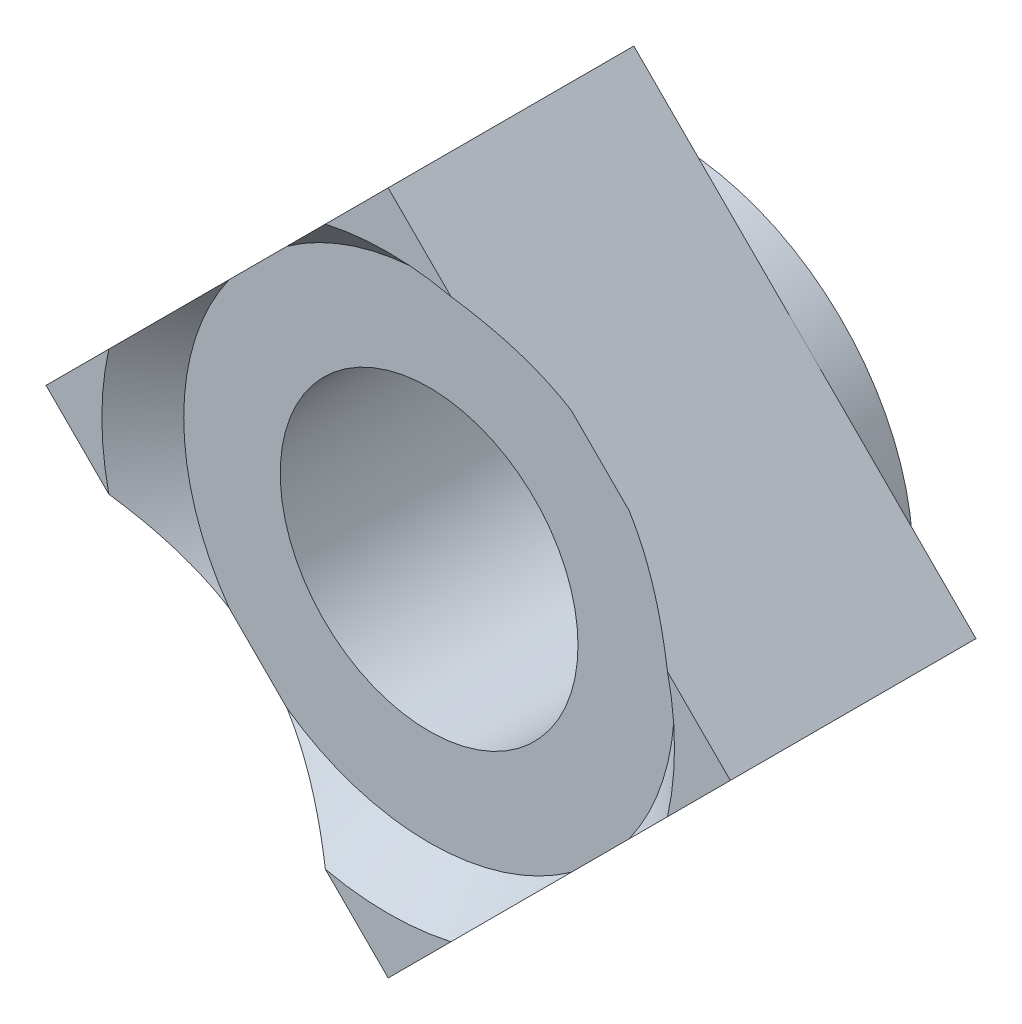
ISO-10303-21;
HEADER;
FILE_DESCRIPTION(('STEP AP214'),'2;1');
FILE_NAME('part.step','',(''),(''),'','','');
FILE_SCHEMA(('AUTOMOTIVE_DESIGN { 1 0 10303 214 1 1 1 1 }'));
ENDSEC;
DATA;
#1=APPLICATION_CONTEXT('core data for automotive mechanical design processes');
#2=APPLICATION_PROTOCOL_DEFINITION('international standard','automotive_design',2000,#1);
#3=PRODUCT_CONTEXT('',#1,'mechanical');
#4=PRODUCT('Part','Part','',(#3));
#5=PRODUCT_RELATED_PRODUCT_CATEGORY('part','',(#4));
#6=PRODUCT_DEFINITION_FORMATION('','',#4);
#7=PRODUCT_DEFINITION_CONTEXT('part definition',#1,'design');
#8=PRODUCT_DEFINITION('design','',#6,#7);
#9=PRODUCT_DEFINITION_SHAPE('','',#8);
#10=(LENGTH_UNIT() NAMED_UNIT(*) SI_UNIT(.MILLI.,.METRE.));
#11=(NAMED_UNIT(*) PLANE_ANGLE_UNIT() SI_UNIT($,.RADIAN.));
#12=(NAMED_UNIT(*) SI_UNIT($,.STERADIAN.) SOLID_ANGLE_UNIT());
#13=UNCERTAINTY_MEASURE_WITH_UNIT(LENGTH_MEASURE(1.E-05),#10,'distance_accuracy_value','');
#14=(GEOMETRIC_REPRESENTATION_CONTEXT(3) GLOBAL_UNCERTAINTY_ASSIGNED_CONTEXT((#13)) GLOBAL_UNIT_ASSIGNED_CONTEXT((#10,
#11,#12)) REPRESENTATION_CONTEXT('',''));
#15=CARTESIAN_POINT('',(0.,0.,0.));
#16=DIRECTION('',(0.,0.,1.));
#17=DIRECTION('',(1.,0.,0.));
#18=AXIS2_PLACEMENT_3D('',#15,#16,#17);
#19=CARTESIAN_POINT('',(0.,0.,0.));
#20=DIRECTION('',(0.,0.,1.));
#21=DIRECTION('',(1.,0.,0.));
#22=AXIS2_PLACEMENT_3D('',#19,#20,#21);
#23=CYLINDRICAL_SURFACE('',#22,4.);
#24=CARTESIAN_POINT('',(0.,0.,6.5));
#25=DIRECTION('',(0.,0.,1.));
#26=DIRECTION('',(1.,0.,0.));
#27=AXIS2_PLACEMENT_3D('',#24,#25,#26);
#28=CIRCLE('',#27,4.);
#29=CARTESIAN_POINT('',(4.,0.,6.5));
#30=VERTEX_POINT('',#29);
#31=EDGE_CURVE('E313',#30,#30,#28,.T.);
#32=ORIENTED_EDGE('',*,*,#31,.T.);
#33=EDGE_LOOP('',(#32));
#34=FACE_BOUND('',#33,.T.);
#35=CARTESIAN_POINT('',(0.,0.,0.2));
#36=DIRECTION('',(0.,0.,-1.));
#37=DIRECTION('',(-1.,0.,0.));
#38=AXIS2_PLACEMENT_3D('',#35,#36,#37);
#39=CIRCLE('',#38,4.);
#40=CARTESIAN_POINT('',(-4.,0.,0.2));
#41=VERTEX_POINT('',#40);
#42=EDGE_CURVE('E39',#41,#41,#39,.F.);
#43=ORIENTED_EDGE('',*,*,#42,.F.);
#44=EDGE_LOOP('',(#43));
#45=FACE_BOUND('',#44,.T.);
#46=ADVANCED_FACE('F35',(#34,#45),#23,.F.);
#47=CARTESIAN_POINT('',(0.,-9.19238815542512,7.6));
#48=DIRECTION('',(0.,0.,-1.));
#49=DIRECTION('',(-1.,0.,0.));
#50=AXIS2_PLACEMENT_3D('',#47,#48,#49);
#51=PLANE('',#50);
#52=DIRECTION('',(-0.707106781186548,-0.707106781186548,0.));
#53=VECTOR('',#52,1.);
#54=CARTESIAN_POINT('',(0.,9.19238815542512,7.6));
#55=LINE('',#54,#53);
#56=CARTESIAN_POINT('',(0.,9.19238815542512,7.6));
#57=VERTEX_POINT('',#56);
#58=CARTESIAN_POINT('',(-1.6873424543288,7.50504570109632,7.6));
#59=VERTEX_POINT('',#58);
#60=EDGE_CURVE('E156',#57,#59,#55,.T.);
#61=ORIENTED_EDGE('',*,*,#60,.T.);
#62=CARTESIAN_POINT('',(0.,0.,7.6));
#63=DIRECTION('',(0.,0.,-1.));
#64=DIRECTION('',(-1.,0.,0.));
#65=AXIS2_PLACEMENT_3D('',#62,#63,#64);
#66=CIRCLE('',#65,7.69238815542512);
#67=CARTESIAN_POINT('',(1.6873424543288,7.50504570109632,7.6));
#68=VERTEX_POINT('',#67);
#69=EDGE_CURVE('E44',#59,#68,#66,.T.);
#70=ORIENTED_EDGE('',*,*,#69,.T.);
#71=DIRECTION('',(-0.707106781186548,0.707106781186548,0.));
#72=VECTOR('',#71,1.);
#73=CARTESIAN_POINT('',(9.19238815542512,0.,7.6));
#74=LINE('',#73,#72);
#75=EDGE_CURVE('E161',#68,#57,#74,.T.);
#76=ORIENTED_EDGE('',*,*,#75,.T.);
#77=EDGE_LOOP('',(#61,#70,#76));
#78=FACE_BOUND('',#77,.T.);
#79=ADVANCED_FACE('F160',(#78),#51,.F.);
#80=CARTESIAN_POINT('',(9.19238815542512,0.,7.6));
#81=VERTEX_POINT('',#80);
#82=CARTESIAN_POINT('',(7.50504570109632,1.6873424543288,7.6));
#83=VERTEX_POINT('',#82);
#84=EDGE_CURVE('E168',#81,#83,#74,.T.);
#85=ORIENTED_EDGE('',*,*,#84,.T.);
#86=CARTESIAN_POINT('',(7.50504570109632,-1.6873424543288,7.6));
#87=VERTEX_POINT('',#86);
#88=EDGE_CURVE('E147',#83,#87,#66,.T.);
#89=ORIENTED_EDGE('',*,*,#88,.T.);
#90=DIRECTION('',(0.707106781186548,0.707106781186547,0.));
#91=VECTOR('',#90,1.);
#92=CARTESIAN_POINT('',(0.,-9.19238815542512,7.6));
#93=LINE('',#92,#91);
#94=EDGE_CURVE('E218',#87,#81,#93,.T.);
#95=ORIENTED_EDGE('',*,*,#94,.T.);
#96=EDGE_LOOP('',(#85,#89,#95));
#97=FACE_BOUND('',#96,.T.);
#98=ADVANCED_FACE('F217',(#97),#51,.F.);
#99=CARTESIAN_POINT('',(0.,-9.19238815542512,7.6));
#100=VERTEX_POINT('',#99);
#101=CARTESIAN_POINT('',(1.6873424543288,-7.50504570109632,7.6));
#102=VERTEX_POINT('',#101);
#103=EDGE_CURVE('E227',#100,#102,#93,.T.);
#104=ORIENTED_EDGE('',*,*,#103,.T.);
#105=CARTESIAN_POINT('',(-1.68734245432881,-7.50504570109632,7.6));
#106=VERTEX_POINT('',#105);
#107=EDGE_CURVE('E207',#102,#106,#66,.T.);
#108=ORIENTED_EDGE('',*,*,#107,.T.);
#109=DIRECTION('',(0.707106781186547,-0.707106781186548,0.));
#110=VECTOR('',#109,1.);
#111=CARTESIAN_POINT('',(-9.19238815542512,0.,7.6));
#112=LINE('',#111,#110);
#113=EDGE_CURVE('E163',#106,#100,#112,.T.);
#114=ORIENTED_EDGE('',*,*,#113,.T.);
#115=EDGE_LOOP('',(#104,#108,#114));
#116=FACE_BOUND('',#115,.T.);
#117=ADVANCED_FACE('F345',(#116),#51,.F.);
#118=CARTESIAN_POINT('',(0.,0.,1.));
#119=DIRECTION('',(0.,0.,-1.));
#120=DIRECTION('',(-1.,0.,0.));
#121=AXIS2_PLACEMENT_3D('',#118,#119,#120);
#122=CYLINDRICAL_SURFACE('',#121,6.5);
#123=CARTESIAN_POINT('',(0.,0.,1.));
#124=DIRECTION('',(0.,0.,1.));
#125=DIRECTION('',(1.,0.,0.));
#126=AXIS2_PLACEMENT_3D('',#123,#124,#125);
#127=CIRCLE('',#126,6.5);
#128=CARTESIAN_POINT('',(4.59619407771256,4.59619407771256,1.));
#129=VERTEX_POINT('',#128);
#130=CARTESIAN_POINT('',(-4.59619407771256,4.59619407771256,1.));
#131=VERTEX_POINT('',#130);
#132=EDGE_CURVE('E201',#129,#131,#127,.T.);
#133=ORIENTED_EDGE('',*,*,#132,.F.);
#134=CARTESIAN_POINT('',(4.59619407771256,-4.59619407771256,1.));
#135=VERTEX_POINT('',#134);
#136=EDGE_CURVE('E59',#135,#129,#127,.T.);
#137=ORIENTED_EDGE('',*,*,#136,.F.);
#138=CARTESIAN_POINT('',(-4.59619407771256,-4.59619407771256,1.));
#139=VERTEX_POINT('',#138);
#140=EDGE_CURVE('E514',#139,#135,#127,.T.);
#141=ORIENTED_EDGE('',*,*,#140,.F.);
#142=EDGE_CURVE('E204',#131,#139,#127,.T.);
#143=ORIENTED_EDGE('',*,*,#142,.F.);
#144=EDGE_LOOP('',(#133,#137,#141,#143));
#145=FACE_BOUND('',#144,.T.);
#146=CARTESIAN_POINT('',(0.,0.,0.));
#147=DIRECTION('',(0.,0.,1.));
#148=DIRECTION('',(1.,0.,0.));
#149=AXIS2_PLACEMENT_3D('',#146,#147,#148);
#150=CIRCLE('',#149,6.5);
#151=CARTESIAN_POINT('',(6.5,0.,0.));
#152=VERTEX_POINT('',#151);
#153=EDGE_CURVE('E200',#152,#152,#150,.T.);
#154=ORIENTED_EDGE('',*,*,#153,.T.);
#155=EDGE_LOOP('',(#154));
#156=FACE_BOUND('',#155,.T.);
#157=ADVANCED_FACE('F37',(#145,#156),#122,.T.);
#158=CARTESIAN_POINT('',(0.,0.,0.));
#159=DIRECTION('',(0.,0.,1.));
#160=DIRECTION('',(1.,0.,0.));
#161=AXIS2_PLACEMENT_3D('',#158,#159,#160);
#162=PLANE('',#161);
#163=CARTESIAN_POINT('',(0.,0.,0.));
#164=DIRECTION('',(0.,0.,-1.));
#165=DIRECTION('',(-1.,0.,0.));
#166=AXIS2_PLACEMENT_3D('',#163,#164,#165);
#167=CIRCLE('',#166,5.11);
#168=CARTESIAN_POINT('',(-5.11,0.,0.));
#169=VERTEX_POINT('',#168);
#170=EDGE_CURVE('E317',#169,#169,#167,.T.);
#171=ORIENTED_EDGE('',*,*,#170,.F.);
#172=EDGE_LOOP('',(#171));
#173=FACE_BOUND('',#172,.T.);
#174=ORIENTED_EDGE('',*,*,#153,.F.);
#175=EDGE_LOOP('',(#174));
#176=FACE_BOUND('',#175,.T.);
#177=ADVANCED_FACE('F356',(#173,#176),#162,.F.);
#178=CARTESIAN_POINT('',(0.,9.19238815542512,1.));
#179=DIRECTION('',(0.,0.,1.));
#180=DIRECTION('',(1.,0.,0.));
#181=AXIS2_PLACEMENT_3D('',#178,#179,#180);
#182=PLANE('',#181);
#183=DIRECTION('',(-0.707106781186548,0.707106781186548,0.));
#184=VECTOR('',#183,1.);
#185=CARTESIAN_POINT('',(9.19238815542512,0.,1.));
#186=LINE('',#185,#184);
#187=CARTESIAN_POINT('',(0.,9.19238815542512,1.));
#188=VERTEX_POINT('',#187);
#189=EDGE_CURVE('E173',#129,#188,#186,.T.);
#190=ORIENTED_EDGE('',*,*,#189,.F.);
#191=ORIENTED_EDGE('',*,*,#132,.T.);
#192=DIRECTION('',(-0.707106781186548,-0.707106781186548,0.));
#193=VECTOR('',#192,1.);
#194=CARTESIAN_POINT('',(0.,9.19238815542512,1.));
#195=LINE('',#194,#193);
#196=EDGE_CURVE('E178',#188,#131,#195,.T.);
#197=ORIENTED_EDGE('',*,*,#196,.F.);
#198=EDGE_LOOP('',(#190,#191,#197));
#199=FACE_BOUND('',#198,.T.);
#200=ADVANCED_FACE('F336',(#199),#182,.F.);
#201=CARTESIAN_POINT('',(-9.19238815542512,0.,1.));
#202=VERTEX_POINT('',#201);
#203=EDGE_CURVE('E177',#131,#202,#195,.T.);
#204=ORIENTED_EDGE('',*,*,#203,.F.);
#205=ORIENTED_EDGE('',*,*,#142,.T.);
#206=DIRECTION('',(0.707106781186547,-0.707106781186548,0.));
#207=VECTOR('',#206,1.);
#208=CARTESIAN_POINT('',(-9.19238815542512,0.,1.));
#209=LINE('',#208,#207);
#210=EDGE_CURVE('E182',#202,#139,#209,.T.);
#211=ORIENTED_EDGE('',*,*,#210,.F.);
#212=EDGE_LOOP('',(#204,#205,#211));
#213=FACE_BOUND('',#212,.T.);
#214=ADVANCED_FACE('F340',(#213),#182,.F.);
#215=CARTESIAN_POINT('',(0.,-9.19238815542512,1.));
#216=VERTEX_POINT('',#215);
#217=EDGE_CURVE('E181',#139,#216,#209,.T.);
#218=ORIENTED_EDGE('',*,*,#217,.F.);
#219=ORIENTED_EDGE('',*,*,#140,.T.);
#220=DIRECTION('',(0.707106781186548,0.707106781186547,0.));
#221=VECTOR('',#220,1.);
#222=CARTESIAN_POINT('',(0.,-9.19238815542512,1.));
#223=LINE('',#222,#221);
#224=EDGE_CURVE('E186',#216,#135,#223,.T.);
#225=ORIENTED_EDGE('',*,*,#224,.F.);
#226=EDGE_LOOP('',(#218,#219,#225));
#227=FACE_BOUND('',#226,.T.);
#228=ADVANCED_FACE('F403',(#227),#182,.F.);
#229=CARTESIAN_POINT('',(9.19238815542512,0.,1.));
#230=VERTEX_POINT('',#229);
#231=EDGE_CURVE('E185',#135,#230,#223,.T.);
#232=ORIENTED_EDGE('',*,*,#231,.F.);
#233=ORIENTED_EDGE('',*,*,#136,.T.);
#234=EDGE_CURVE('E174',#230,#129,#186,.T.);
#235=ORIENTED_EDGE('',*,*,#234,.F.);
#236=EDGE_LOOP('',(#232,#233,#235));
#237=FACE_BOUND('',#236,.T.);
#238=ADVANCED_FACE('F285',(#237),#182,.F.);
#239=CARTESIAN_POINT('',(9.19238815542512,0.,6.5));
#240=DIRECTION('',(-0.707106781186548,-0.707106781186548,0.));
#241=DIRECTION('',(0.707106781186548,-0.707106781186548,0.));
#242=AXIS2_PLACEMENT_3D('',#239,#240,#241);
#243=PLANE('',#242);
#244=ORIENTED_EDGE('',*,*,#75,.F.);
#245=CARTESIAN_POINT('',(-4.37320568363378,13.5655938390589,14.1606909560399));
#246=CARTESIAN_POINT('',(-4.24234769604201,13.4347358514671,13.9959977897325));
#247=CARTESIAN_POINT('',(-4.11122933467802,13.3036174901031,13.8317186754357));
#248=CARTESIAN_POINT('',(-3.8484007918818,13.0407889473069,13.5041057028385));
#249=CARTESIAN_POINT('',(-3.71669060332668,12.9090787587518,13.3407718559691));
#250=CARTESIAN_POINT('',(-3.32047540578415,12.5128635612093,12.8522527354128));
#251=CARTESIAN_POINT('',(-3.05497984062777,12.2473679960529,12.5286685799446));
#252=CARTESIAN_POINT('',(-2.51710978938381,11.7094979448089,11.8828881941562));
#253=CARTESIAN_POINT('',(-2.24469075444122,11.4370789098663,11.5607660516555));
#254=CARTESIAN_POINT('',(-1.69538980366159,10.8877779590867,10.9243378533752));
#255=CARTESIAN_POINT('',(-1.41850881583729,10.6108969712624,10.6100302060238));
#256=CARTESIAN_POINT('',(-1.00568700136079,10.1980751567859,10.1544865592589));
#257=CARTESIAN_POINT('',(-0.872075822645925,10.064463978071,10.0090272788004));
#258=CARTESIAN_POINT('',(-0.603278864868857,9.79566702029398,9.72105203944469));
#259=CARTESIAN_POINT('',(-0.468093126707087,9.66048128213221,9.57853600435987));
#260=CARTESIAN_POINT('',(-0.195811468110635,9.38819962353575,9.29693462835995));
#261=CARTESIAN_POINT('',(-0.0587143922114394,9.25110254763656,9.15785151718927));
#262=CARTESIAN_POINT('',(0.217599288360994,8.97478886706412,8.88395611603774));
#263=CARTESIAN_POINT('',(0.356815860176665,8.83557229524845,8.74914375994896));
#264=CARTESIAN_POINT('',(0.637270700431844,8.55511745499327,8.48515848973342));
#265=CARTESIAN_POINT('',(0.778501179450081,8.41388697597504,8.35596908350448));
#266=CARTESIAN_POINT('',(1.0638163110973,8.12857184432782,8.10398583071387));
#267=CARTESIAN_POINT('',(1.20790120812599,7.98448694729912,7.98119253509253));
#268=CARTESIAN_POINT('',(1.49919099291572,7.6931971625094,7.74371773831591));
#269=CARTESIAN_POINT('',(1.64639239527917,7.54599576014594,7.62902773924691));
#270=CARTESIAN_POINT('',(1.94446390581621,7.24792424960891,7.4096751260565));
#271=CARTESIAN_POINT('',(2.09533307947526,7.09705507594985,7.3050099905786));
#272=CARTESIAN_POINT('',(2.39024792146158,6.80214023396354,7.11527702402801));
#273=CARTESIAN_POINT('',(2.53401167085249,6.65837648457263,7.02934352655797));
#274=CARTESIAN_POINT('',(2.75237735993217,6.44001079549295,6.91049018391965));
#275=CARTESIAN_POINT('',(2.82561796016232,6.3667701952628,6.87254746370234));
#276=CARTESIAN_POINT('',(2.97303033157869,6.21935782384643,6.80034343597957));
#277=CARTESIAN_POINT('',(3.04720244202852,6.1451857133966,6.76608351592293));
#278=CARTESIAN_POINT('',(3.27029326995691,5.92209488546821,6.66971874888536));
#279=CARTESIAN_POINT('',(3.42054594898428,5.77184220644084,6.61360843220191));
#280=CARTESIAN_POINT('',(3.72393481256642,5.46845334285869,6.52031824718476));
#281=CARTESIAN_POINT('',(3.87706984694982,5.3153183084753,6.48313098719779));
#282=CARTESIAN_POINT('',(4.1874547344676,5.00493342095752,6.42957888309975));
#283=CARTESIAN_POINT('',(4.34473204023448,4.84765611519064,6.41352480778788));
#284=CARTESIAN_POINT('',(4.65961325652717,4.53277489889795,6.40441860579957));
#285=CARTESIAN_POINT('',(4.81721714359881,4.37517101182631,6.41136488086601));
#286=CARTESIAN_POINT('',(5.13153199426679,4.06085616115833,6.44779085831615));
#287=CARTESIAN_POINT('',(5.28823927689117,3.90414887853395,6.47733290327711));
#288=CARTESIAN_POINT('',(5.59899990086368,3.59338825456144,6.55700724391262));
#289=CARTESIAN_POINT('',(5.75305249928645,3.43933565613867,6.60714520898608));
#290=CARTESIAN_POINT('',(6.10986822740375,3.08251992802137,6.74537640603481));
#291=CARTESIAN_POINT('',(6.31124265106066,2.88114550436446,6.84058786666568));
#292=CARTESIAN_POINT('',(6.70722545736078,2.48516269806434,7.05574996019089));
#293=CARTESIAN_POINT('',(6.90182963419258,2.29055852123254,7.17571566117637));
#294=CARTESIAN_POINT('',(7.28661856241242,1.9057695930127,7.43549484566032));
#295=CARTESIAN_POINT('',(7.47673952953934,1.71564862588578,7.57549508233349));
#296=CARTESIAN_POINT('',(7.75766425767911,1.43472389774601,7.79606654737262));
#297=CARTESIAN_POINT('',(7.85058570931803,1.34180244610709,7.87134275292938));
#298=CARTESIAN_POINT('',(8.03514718690393,1.15724096852119,8.02497939489965));
#299=CARTESIAN_POINT('',(8.12678721557541,1.0656009398497,8.10333982475427));
#300=CARTESIAN_POINT('',(8.34240155776135,0.849986597663772,8.29206060687592));
#301=CARTESIAN_POINT('',(8.46586545898647,0.726522696438648,8.40358565469752));
#302=CARTESIAN_POINT('',(8.71086681720011,0.481521338225011,8.6307989339234));
#303=CARTESIAN_POINT('',(8.83240414158062,0.359984013844502,8.74648745012599));
#304=CARTESIAN_POINT('',(9.19454379082994,-0.00215563540482074,9.09880270982188));
#305=CARTESIAN_POINT('',(9.43261756021252,-0.240229404787403,9.34062908491375));
#306=CARTESIAN_POINT('',(9.9039493792708,-0.711561223845683,9.834572053988));
#307=CARTESIAN_POINT('',(10.1371984706342,-0.944810315209061,10.0867055829594));
#308=CARTESIAN_POINT('',(10.5995963491878,-1.40720819376271,10.5982725479288));
#309=CARTESIAN_POINT('',(10.8287456870275,-1.63635753160234,10.8577049913635));
#310=CARTESIAN_POINT('',(11.2702187287827,-2.07783057335763,11.3664296449583));
#311=CARTESIAN_POINT('',(11.4827287331864,-2.29034057776131,11.6153996611254));
#312=CARTESIAN_POINT('',(11.9054612862639,-2.71307313083877,12.1172147954145));
#313=CARTESIAN_POINT('',(12.1156837324477,-2.92329557702254,12.3700600859489));
#314=CARTESIAN_POINT('',(12.5334067232698,-3.34101856784469,12.8778058580343));
#315=CARTESIAN_POINT('',(12.740914830915,-3.54852667548991,13.1326939190144));
#316=CARTESIAN_POINT('',(13.1543547156107,-3.96196656018561,13.6449572097385));
#317=CARTESIAN_POINT('',(13.3602866477541,-4.16789849232898,13.9023321889859));
#318=CARTESIAN_POINT('',(13.5655938390589,-4.37320568363378,14.1606909560399));
#319=B_SPLINE_CURVE_WITH_KNOTS('',3,(#245,#246,#247,#248,#249,#250,#251,#252,#253,#254,#255,
#256,#257,#258,#259,#260,#261,#262,#263,#264,#265,#266,#267,#268,#269,#270,#271,#272,#273,#274,
#275,#276,#277,#278,#279,#280,#281,#282,#283,#284,#285,#286,#287,#288,#289,#290,#291,#292,#293,
#294,#295,#296,#297,#298,#299,#300,#301,#302,#303,#304,#305,#306,#307,#308,#309,#310,#311,#312,
#313,#314,#315,#316,#317,#318),.UNSPECIFIED.,.F.,.F.,(4,2,2,2,2,2,2,2,2,2,2,2,2,2,2,2,2,2,2,2,2,
2,2,2,2,2,2,2,2,2,2,2,2,2,2,2,4),(0.,0.743196509430142,1.48640198761872,2.97334780780624,
4.479829175437,5.98600116320509,6.70135332276467,7.41668694173935,8.13247356704554,
8.84824910711887,9.5617601576551,10.2753325664413,10.9881451907873,11.7007780620329,
12.3625293236585,12.6933933615485,13.0243816146637,13.6829063238144,14.3411736046791,
15.0090165712263,15.6768131314206,16.3464588433456,17.0162890109983,17.9155446215712,
18.8153492391161,19.7241659270354,20.1784674992148,20.632768105331,21.2542405933247,
21.8757556736905,23.1190675323911,24.3645114776649,25.6097868686873,26.780544788705,
27.9513549482639,29.1174376750647,30.2834041469143),.UNSPECIFIED.);
#320=CARTESIAN_POINT('',(3.81851111152726,5.37387704389786,6.5));
#321=VERTEX_POINT('',#320);
#322=EDGE_CURVE('E143',#68,#321,#319,.T.);
#323=ORIENTED_EDGE('',*,*,#322,.T.);
#324=DIRECTION('',(0.707106781186548,-0.707106781186548,0.));
#325=VECTOR('',#324,1.);
#326=CARTESIAN_POINT('',(9.19238815542512,0.,6.5));
#327=LINE('',#326,#325);
#328=CARTESIAN_POINT('',(5.37387704389786,3.81851111152726,6.5));
#329=VERTEX_POINT('',#328);
#330=EDGE_CURVE('E228',#321,#329,#327,.T.);
#331=ORIENTED_EDGE('',*,*,#330,.T.);
#332=EDGE_CURVE('E236',#329,#83,#319,.T.);
#333=ORIENTED_EDGE('',*,*,#332,.T.);
#334=ORIENTED_EDGE('',*,*,#84,.F.);
#335=DIRECTION('',(0.,0.,-1.));
#336=VECTOR('',#335,1.);
#337=CARTESIAN_POINT('',(9.19238815542512,0.,6.5));
#338=LINE('',#337,#336);
#339=EDGE_CURVE('E189',#81,#230,#338,.T.);
#340=ORIENTED_EDGE('',*,*,#339,.T.);
#341=ORIENTED_EDGE('',*,*,#234,.T.);
#342=ORIENTED_EDGE('',*,*,#189,.T.);
#343=DIRECTION('',(0.,0.,-1.));
#344=VECTOR('',#343,1.);
#345=CARTESIAN_POINT('',(0.,9.19238815542512,6.5));
#346=LINE('',#345,#344);
#347=EDGE_CURVE('E198',#57,#188,#346,.T.);
#348=ORIENTED_EDGE('',*,*,#347,.F.);
#349=EDGE_LOOP('',(#244,#323,#331,#333,#334,#340,#341,#342,#348));
#350=FACE_BOUND('',#349,.T.);
#351=ADVANCED_FACE('F247',(#350),#243,.F.);
#352=CARTESIAN_POINT('',(0.,9.19238815542512,6.5));
#353=DIRECTION('',(0.707106781186548,-0.707106781186548,0.));
#354=DIRECTION('',(0.707106781186548,0.707106781186548,0.));
#355=AXIS2_PLACEMENT_3D('',#352,#353,#354);
#356=PLANE('',#355);
#357=CARTESIAN_POINT('',(-7.50504570109632,1.6873424543288,7.6));
#358=VERTEX_POINT('',#357);
#359=CARTESIAN_POINT('',(-9.19238815542512,0.,7.6));
#360=VERTEX_POINT('',#359);
#361=EDGE_CURVE('E164',#358,#360,#55,.T.);
#362=ORIENTED_EDGE('',*,*,#361,.F.);
#363=CARTESIAN_POINT('',(-13.5655938390589,-4.37320568363378,14.1606909560399));
#364=CARTESIAN_POINT('',(-13.4347358514671,-4.24234769604201,13.9959977897325));
#365=CARTESIAN_POINT('',(-13.3036174901031,-4.11122933467803,13.8317186754357));
#366=CARTESIAN_POINT('',(-13.0407889473069,-3.8484007918818,13.5041057028385));
#367=CARTESIAN_POINT('',(-12.9090787587518,-3.71669060332668,13.3407718559691));
#368=CARTESIAN_POINT('',(-12.5128635612093,-3.32047540578415,12.8522527354128));
#369=CARTESIAN_POINT('',(-12.2473679960529,-3.05497984062777,12.5286685799446));
#370=CARTESIAN_POINT('',(-11.7094979448089,-2.51710978938381,11.8828881941562));
#371=CARTESIAN_POINT('',(-11.4370789098663,-2.24469075444122,11.5607660516555));
#372=CARTESIAN_POINT('',(-10.8877779590867,-1.69538980366159,10.9243378533752));
#373=CARTESIAN_POINT('',(-10.6108969712624,-1.41850881583729,10.6100302060238));
#374=CARTESIAN_POINT('',(-10.1980751567859,-1.00568700136079,10.1544865592589));
#375=CARTESIAN_POINT('',(-10.064463978071,-0.872075822645928,10.0090272788004));
#376=CARTESIAN_POINT('',(-9.79566702029398,-0.60327886486886,9.72105203944469));
#377=CARTESIAN_POINT('',(-9.66048128213221,-0.46809312670709,9.57853600435987));
#378=CARTESIAN_POINT('',(-9.38819962353576,-0.195811468110637,9.29693462835995));
#379=CARTESIAN_POINT('',(-9.25110254763656,-0.0587143922114405,9.15785151718927));
#380=CARTESIAN_POINT('',(-8.97478886706413,0.217599288360993,8.88395611603774));
#381=CARTESIAN_POINT('',(-8.83557229524845,0.356815860176664,8.74914375994896));
#382=CARTESIAN_POINT('',(-8.55511745499327,0.637270700431844,8.48515848973342));
#383=CARTESIAN_POINT('',(-8.41388697597504,0.778501179450081,8.35596908350448));
#384=CARTESIAN_POINT('',(-8.12857184432782,1.0638163110973,8.10398583071387));
#385=CARTESIAN_POINT('',(-7.98448694729912,1.207901208126,7.98119253509253));
#386=CARTESIAN_POINT('',(-7.6931971625094,1.49919099291572,7.74371773831591));
#387=CARTESIAN_POINT('',(-7.54599576014594,1.64639239527917,7.62902773924691));
#388=CARTESIAN_POINT('',(-7.24792424960891,1.94446390581621,7.4096751260565));
#389=CARTESIAN_POINT('',(-7.09705507594985,2.09533307947526,7.3050099905786));
#390=CARTESIAN_POINT('',(-6.80214023396354,2.39024792146158,7.11527702402801));
#391=CARTESIAN_POINT('',(-6.65837648457263,2.53401167085249,7.02934352655797));
#392=CARTESIAN_POINT('',(-6.44001079549295,2.75237735993217,6.91049018391965));
#393=CARTESIAN_POINT('',(-6.3667701952628,2.82561796016232,6.87254746370234));
#394=CARTESIAN_POINT('',(-6.21935782384643,2.97303033157869,6.80034343597957));
#395=CARTESIAN_POINT('',(-6.1451857133966,3.04720244202852,6.76608351592293));
#396=CARTESIAN_POINT('',(-5.92209488546821,3.27029326995691,6.66971874888536));
#397=CARTESIAN_POINT('',(-5.77184220644083,3.42054594898428,6.6136084322019));
#398=CARTESIAN_POINT('',(-5.46845334285869,3.72393481256642,6.52031824718476));
#399=CARTESIAN_POINT('',(-5.3153183084753,3.87706984694982,6.48313098719779));
#400=CARTESIAN_POINT('',(-5.00493342095752,4.1874547344676,6.42957888309975));
#401=CARTESIAN_POINT('',(-4.84765611519064,4.34473204023448,6.41352480778788));
#402=CARTESIAN_POINT('',(-4.53277489889795,4.65961325652717,6.40441860579957));
#403=CARTESIAN_POINT('',(-4.37517101182631,4.81721714359881,6.41136488086601));
#404=CARTESIAN_POINT('',(-4.06085616115832,5.13153199426679,6.44779085831614));
#405=CARTESIAN_POINT('',(-3.90414887853394,5.28823927689117,6.47733290327711));
#406=CARTESIAN_POINT('',(-3.59338825456143,5.59899990086368,6.55700724391262));
#407=CARTESIAN_POINT('',(-3.43933565613867,5.75305249928645,6.60714520898608));
#408=CARTESIAN_POINT('',(-3.08251992802137,6.10986822740375,6.74537640603481));
#409=CARTESIAN_POINT('',(-2.88114550436446,6.31124265106066,6.84058786666568));
#410=CARTESIAN_POINT('',(-2.48516269806434,6.70722545736078,7.05574996019089));
#411=CARTESIAN_POINT('',(-2.29055852123254,6.90182963419258,7.17571566117637));
#412=CARTESIAN_POINT('',(-1.90576959301269,7.28661856241242,7.43549484566032));
#413=CARTESIAN_POINT('',(-1.71564862588578,7.47673952953934,7.57549508233349));
#414=CARTESIAN_POINT('',(-1.434723897746,7.75766425767911,7.79606654737263));
#415=CARTESIAN_POINT('',(-1.34180244610708,7.85058570931803,7.87134275292938));
#416=CARTESIAN_POINT('',(-1.15724096852118,8.03514718690393,8.02497939489965));
#417=CARTESIAN_POINT('',(-1.0656009398497,8.12678721557542,8.10333982475428));
#418=CARTESIAN_POINT('',(-0.849986597663768,8.34240155776135,8.29206060687592));
#419=CARTESIAN_POINT('',(-0.726522696438644,8.46586545898647,8.40358565469752));
#420=CARTESIAN_POINT('',(-0.481521338225007,8.71086681720011,8.6307989339234));
#421=CARTESIAN_POINT('',(-0.359984013844498,8.83240414158062,8.746487450126));
#422=CARTESIAN_POINT('',(0.00215563540482567,9.19454379082994,9.09880270982189));
#423=CARTESIAN_POINT('',(0.240229404787408,9.43261756021253,9.34062908491375));
#424=CARTESIAN_POINT('',(0.71156122384569,9.90394937927081,9.834572053988));
#425=CARTESIAN_POINT('',(0.944810315209068,10.1371984706342,10.0867055829594));
#426=CARTESIAN_POINT('',(1.40720819376271,10.5995963491878,10.5982725479288));
#427=CARTESIAN_POINT('',(1.63635753160235,10.8287456870275,10.8577049913635));
#428=CARTESIAN_POINT('',(2.07783057335763,11.2702187287827,11.3664296449583));
#429=CARTESIAN_POINT('',(2.29034057776131,11.4827287331864,11.6153996611254));
#430=CARTESIAN_POINT('',(2.71307313083877,11.9054612862639,12.1172147954145));
#431=CARTESIAN_POINT('',(2.92329557702255,12.1156837324477,12.3700600859489));
#432=CARTESIAN_POINT('',(3.3410185678447,12.5334067232698,12.8778058580343));
#433=CARTESIAN_POINT('',(3.54852667548992,12.740914830915,13.1326939190144));
#434=CARTESIAN_POINT('',(3.96196656018561,13.1543547156107,13.6449572097386));
#435=CARTESIAN_POINT('',(4.16789849232899,13.3602866477541,13.9023321889859));
#436=CARTESIAN_POINT('',(4.37320568363378,13.5655938390589,14.1606909560399));
#437=B_SPLINE_CURVE_WITH_KNOTS('',3,(#363,#364,#365,#366,#367,#368,#369,#370,#371,#372,#373,
#374,#375,#376,#377,#378,#379,#380,#381,#382,#383,#384,#385,#386,#387,#388,#389,#390,#391,#392,
#393,#394,#395,#396,#397,#398,#399,#400,#401,#402,#403,#404,#405,#406,#407,#408,#409,#410,#411,
#412,#413,#414,#415,#416,#417,#418,#419,#420,#421,#422,#423,#424,#425,#426,#427,#428,#429,#430,
#431,#432,#433,#434,#435,#436),.UNSPECIFIED.,.F.,.F.,(4,2,2,2,2,2,2,2,2,2,2,2,2,2,2,2,2,2,2,2,2,
2,2,2,2,2,2,2,2,2,2,2,2,2,2,2,4),(0.,0.743196509430144,1.48640198761872,2.97334780780624,
4.479829175437,5.98600116320509,6.70135332276467,7.41668694173935,8.13247356704554,
8.84824910711887,9.5617601576551,10.2753325664413,10.9881451907873,11.700778062033,
12.3625293236585,12.6933933615485,13.0243816146637,13.6829063238144,14.3411736046791,
15.0090165712263,15.6768131314206,16.3464588433456,17.0162890109983,17.9155446215712,
18.8153492391161,19.7241659270354,20.1784674992148,20.632768105331,21.2542405933247,
21.8757556736905,23.1190675323911,24.3645114776649,25.6097868686873,26.780544788705,
27.9513549482639,29.1174376750647,30.2834041469143),.UNSPECIFIED.);
#438=CARTESIAN_POINT('',(-5.37387704389786,3.81851111152725,6.5));
#439=VERTEX_POINT('',#438);
#440=EDGE_CURVE('E51',#358,#439,#437,.T.);
#441=ORIENTED_EDGE('',*,*,#440,.T.);
#442=DIRECTION('',(0.707106781186548,0.707106781186548,0.));
#443=VECTOR('',#442,1.);
#444=CARTESIAN_POINT('',(0.,9.19238815542512,6.5));
#445=LINE('',#444,#443);
#446=CARTESIAN_POINT('',(-3.81851111152725,5.37387704389786,6.5));
#447=VERTEX_POINT('',#446);
#448=EDGE_CURVE('E157',#439,#447,#445,.T.);
#449=ORIENTED_EDGE('',*,*,#448,.T.);
#450=EDGE_CURVE('E140',#447,#59,#437,.T.);
#451=ORIENTED_EDGE('',*,*,#450,.T.);
#452=ORIENTED_EDGE('',*,*,#60,.F.);
#453=ORIENTED_EDGE('',*,*,#347,.T.);
#454=ORIENTED_EDGE('',*,*,#196,.T.);
#455=ORIENTED_EDGE('',*,*,#203,.T.);
#456=DIRECTION('',(0.,0.,-1.));
#457=VECTOR('',#456,1.);
#458=CARTESIAN_POINT('',(-9.19238815542512,0.,6.5));
#459=LINE('',#458,#457);
#460=EDGE_CURVE('E195',#360,#202,#459,.T.);
#461=ORIENTED_EDGE('',*,*,#460,.F.);
#462=EDGE_LOOP('',(#362,#441,#449,#451,#452,#453,#454,#455,#461));
#463=FACE_BOUND('',#462,.T.);
#464=ADVANCED_FACE('F154',(#463),#356,.F.);
#465=CARTESIAN_POINT('',(-9.19238815542512,0.,6.5));
#466=DIRECTION('',(0.707106781186548,0.707106781186547,0.));
#467=DIRECTION('',(-0.707106781186547,0.707106781186548,0.));
#468=AXIS2_PLACEMENT_3D('',#465,#466,#467);
#469=PLANE('',#468);
#470=ORIENTED_EDGE('',*,*,#113,.F.);
#471=CARTESIAN_POINT('',(4.37320568363377,-13.5655938390589,14.1606909560399));
#472=CARTESIAN_POINT('',(4.242347696042,-13.4347358514671,13.9959977897325));
#473=CARTESIAN_POINT('',(4.11122933467801,-13.3036174901031,13.8317186754357));
#474=CARTESIAN_POINT('',(3.84840079188179,-13.0407889473069,13.5041057028385));
#475=CARTESIAN_POINT('',(3.71669060332667,-12.9090787587518,13.3407718559691));
#476=CARTESIAN_POINT('',(3.32047540578414,-12.5128635612093,12.8522527354128));
#477=CARTESIAN_POINT('',(3.05497984062776,-12.2473679960529,12.5286685799446));
#478=CARTESIAN_POINT('',(2.51710978938379,-11.7094979448089,11.8828881941562));
#479=CARTESIAN_POINT('',(2.24469075444121,-11.4370789098663,11.5607660516555));
#480=CARTESIAN_POINT('',(1.69538980366158,-10.8877779590867,10.9243378533752));
#481=CARTESIAN_POINT('',(1.41850881583728,-10.6108969712624,10.6100302060238));
#482=CARTESIAN_POINT('',(1.00568700136078,-10.1980751567859,10.1544865592589));
#483=CARTESIAN_POINT('',(0.872075822645915,-10.064463978071,10.0090272788004));
#484=CARTESIAN_POINT('',(0.603278864868846,-9.79566702029397,9.72105203944468));
#485=CARTESIAN_POINT('',(0.468093126707076,-9.6604812821322,9.57853600435986));
#486=CARTESIAN_POINT('',(0.195811468110622,-9.38819962353575,9.29693462835994));
#487=CARTESIAN_POINT('',(0.0587143922114263,-9.25110254763655,9.15785151718926));
#488=CARTESIAN_POINT('',(-0.217599288361008,-8.97478886706412,8.88395611603773));
#489=CARTESIAN_POINT('',(-0.35681586017668,-8.83557229524845,8.74914375994895));
#490=CARTESIAN_POINT('',(-0.637270700431861,-8.55511745499327,8.48515848973341));
#491=CARTESIAN_POINT('',(-0.778501179450096,-8.41388697597503,8.35596908350447));
#492=CARTESIAN_POINT('',(-1.06381631109732,-8.12857184432781,8.10398583071386));
#493=CARTESIAN_POINT('',(-1.20790120812601,-7.98448694729911,7.98119253509252));
#494=CARTESIAN_POINT('',(-1.49919099291574,-7.69319716250939,7.74371773831591));
#495=CARTESIAN_POINT('',(-1.64639239527919,-7.54599576014593,7.62902773924691));
#496=CARTESIAN_POINT('',(-1.94446390581623,-7.24792424960889,7.40967512605649));
#497=CARTESIAN_POINT('',(-2.09533307947528,-7.09705507594984,7.30500999057859));
#498=CARTESIAN_POINT('',(-2.3902479214616,-6.80214023396353,7.11527702402801));
#499=CARTESIAN_POINT('',(-2.53401167085251,-6.65837648457262,7.02934352655797));
#500=CARTESIAN_POINT('',(-2.75237735993219,-6.44001079549294,6.91049018391965));
#501=CARTESIAN_POINT('',(-2.82561796016234,-6.36677019526279,6.87254746370233));
#502=CARTESIAN_POINT('',(-2.97303033157871,-6.21935782384642,6.80034343597956));
#503=CARTESIAN_POINT('',(-3.04720244202854,-6.14518571339659,6.76608351592293));
#504=CARTESIAN_POINT('',(-3.27029326995693,-5.9220948854682,6.66971874888536));
#505=CARTESIAN_POINT('',(-3.42054594898431,-5.77184220644082,6.6136084322019));
#506=CARTESIAN_POINT('',(-3.72393481256645,-5.46845334285868,6.52031824718476));
#507=CARTESIAN_POINT('',(-3.87706984694984,-5.31531830847528,6.48313098719779));
#508=CARTESIAN_POINT('',(-4.18745473446762,-5.0049334209575,6.42957888309975));
#509=CARTESIAN_POINT('',(-4.3447320402345,-4.84765611519062,6.41352480778788));
#510=CARTESIAN_POINT('',(-4.65961325652719,-4.53277489889793,6.40441860579958));
#511=CARTESIAN_POINT('',(-4.81721714359883,-4.37517101182629,6.41136488086602));
#512=CARTESIAN_POINT('',(-5.13153199426682,-4.06085616115831,6.44779085831615));
#513=CARTESIAN_POINT('',(-5.2882392768912,-3.90414887853393,6.47733290327712));
#514=CARTESIAN_POINT('',(-5.59899990086371,-3.59338825456142,6.55700724391263));
#515=CARTESIAN_POINT('',(-5.75305249928647,-3.43933565613865,6.6071452089861));
#516=CARTESIAN_POINT('',(-6.10986822740377,-3.08251992802135,6.74537640603482));
#517=CARTESIAN_POINT('',(-6.31124265106068,-2.88114550436444,6.84058786666569));
#518=CARTESIAN_POINT('',(-6.70722545736081,-2.48516269806432,7.05574996019091));
#519=CARTESIAN_POINT('',(-6.90182963419261,-2.29055852123252,7.17571566117639));
#520=CARTESIAN_POINT('',(-7.28661856241245,-1.90576959301267,7.43549484566034));
#521=CARTESIAN_POINT('',(-7.47673952953937,-1.71564862588575,7.57549508233351));
#522=CARTESIAN_POINT('',(-7.75766425767914,-1.43472389774598,7.79606654737265));
#523=CARTESIAN_POINT('',(-7.85058570931806,-1.34180244610706,7.87134275292941));
#524=CARTESIAN_POINT('',(-8.03514718690396,-1.15724096852116,8.02497939489968));
#525=CARTESIAN_POINT('',(-8.12678721557545,-1.06560093984967,8.10333982475431));
#526=CARTESIAN_POINT('',(-8.34240155776138,-0.84998659766374,8.29206060687596));
#527=CARTESIAN_POINT('',(-8.4658654589865,-0.726522696438617,8.40358565469755));
#528=CARTESIAN_POINT('',(-8.71086681720014,-0.481521338224981,8.63079893392343));
#529=CARTESIAN_POINT('',(-8.83240414158065,-0.359984013844474,8.74648745012602));
#530=CARTESIAN_POINT('',(-9.19454379082997,0.00215563540484695,9.09880270982191));
#531=CARTESIAN_POINT('',(-9.43261756021255,0.240229404787427,9.34062908491377));
#532=CARTESIAN_POINT('',(-9.90394937927083,0.711561223845704,9.83457205398802));
#533=CARTESIAN_POINT('',(-10.1371984706342,0.94481031520908,10.0867055829594));
#534=CARTESIAN_POINT('',(-10.5995963491878,1.40720819376272,10.5982725479288));
#535=CARTESIAN_POINT('',(-10.8287456870275,1.63635753160235,10.8577049913635));
#536=CARTESIAN_POINT('',(-11.2702187287828,2.07783057335764,11.3664296449583));
#537=CARTESIAN_POINT('',(-11.4827287331864,2.29034057776132,11.6153996611254));
#538=CARTESIAN_POINT('',(-11.9054612862639,2.71307313083877,12.1172147954145));
#539=CARTESIAN_POINT('',(-12.1156837324477,2.92329557702255,12.3700600859489));
#540=CARTESIAN_POINT('',(-12.5334067232698,3.3410185678447,12.8778058580343));
#541=CARTESIAN_POINT('',(-12.740914830915,3.54852667548992,13.1326939190144));
#542=CARTESIAN_POINT('',(-13.1543547156107,3.96196656018561,13.6449572097386));
#543=CARTESIAN_POINT('',(-13.3602866477541,4.16789849232898,13.9023321889859));
#544=CARTESIAN_POINT('',(-13.5655938390589,4.37320568363377,14.1606909560399));
#545=B_SPLINE_CURVE_WITH_KNOTS('',3,(#471,#472,#473,#474,#475,#476,#477,#478,#479,#480,#481,
#482,#483,#484,#485,#486,#487,#488,#489,#490,#491,#492,#493,#494,#495,#496,#497,#498,#499,#500,
#501,#502,#503,#504,#505,#506,#507,#508,#509,#510,#511,#512,#513,#514,#515,#516,#517,#518,#519,
#520,#521,#522,#523,#524,#525,#526,#527,#528,#529,#530,#531,#532,#533,#534,#535,#536,#537,#538,
#539,#540,#541,#542,#543,#544),.UNSPECIFIED.,.F.,.F.,(4,2,2,2,2,2,2,2,2,2,2,2,2,2,2,2,2,2,2,2,2,
2,2,2,2,2,2,2,2,2,2,2,2,2,2,2,4),(0.,0.743196509430144,1.48640198761872,2.97334780780624,
4.479829175437,5.9860011632051,6.70135332276468,7.41668694173935,8.13247356704555,
8.84824910711888,9.56176015765511,10.2753325664413,10.9881451907873,11.700778062033,
12.3625293236585,12.6933933615485,13.0243816146637,13.6829063238144,14.3411736046791,
15.0090165712264,15.6768131314206,16.3464588433456,17.0162890109984,17.9155446215713,
18.8153492391162,19.7241659270354,20.1784674992148,20.632768105331,21.2542405933247,
21.8757556736906,23.1190675323911,24.3645114776649,25.6097868686873,26.780544788705,
27.9513549482639,29.1174376750647,30.2834041469143),.UNSPECIFIED.);
#546=CARTESIAN_POINT('',(-3.81851111152728,-5.37387704389784,6.5));
#547=VERTEX_POINT('',#546);
#548=EDGE_CURVE('E158',#106,#547,#545,.T.);
#549=ORIENTED_EDGE('',*,*,#548,.T.);
#550=DIRECTION('',(-0.707106781186547,0.707106781186548,0.));
#551=VECTOR('',#550,1.);
#552=CARTESIAN_POINT('',(-9.19238815542512,0.,6.5));
#553=LINE('',#552,#551);
#554=CARTESIAN_POINT('',(-5.37387704389785,-3.81851111152728,6.5));
#555=VERTEX_POINT('',#554);
#556=EDGE_CURVE('E233',#547,#555,#553,.T.);
#557=ORIENTED_EDGE('',*,*,#556,.T.);
#558=CARTESIAN_POINT('',(-7.50504570109632,-1.6873424543288,7.6));
#559=VERTEX_POINT('',#558);
#560=EDGE_CURVE('E269',#555,#559,#545,.T.);
#561=ORIENTED_EDGE('',*,*,#560,.T.);
#562=EDGE_CURVE('E166',#360,#559,#112,.T.);
#563=ORIENTED_EDGE('',*,*,#562,.F.);
#564=ORIENTED_EDGE('',*,*,#460,.T.);
#565=ORIENTED_EDGE('',*,*,#210,.T.);
#566=ORIENTED_EDGE('',*,*,#217,.T.);
#567=DIRECTION('',(0.,0.,-1.));
#568=VECTOR('',#567,1.);
#569=CARTESIAN_POINT('',(0.,-9.19238815542512,6.5));
#570=LINE('',#569,#568);
#571=EDGE_CURVE('E192',#100,#216,#570,.T.);
#572=ORIENTED_EDGE('',*,*,#571,.F.);
#573=EDGE_LOOP('',(#470,#549,#557,#561,#563,#564,#565,#566,#572));
#574=FACE_BOUND('',#573,.T.);
#575=ADVANCED_FACE('F275',(#574),#469,.F.);
#576=CARTESIAN_POINT('',(0.,-9.19238815542512,6.5));
#577=DIRECTION('',(-0.707106781186547,0.707106781186548,0.));
#578=DIRECTION('',(-0.707106781186548,-0.707106781186547,0.));
#579=AXIS2_PLACEMENT_3D('',#576,#577,#578);
#580=PLANE('',#579);
#581=ORIENTED_EDGE('',*,*,#94,.F.);
#582=CARTESIAN_POINT('',(13.5655938390589,4.37320568363377,14.1606909560399));
#583=CARTESIAN_POINT('',(13.4347358514671,4.24234769604201,13.9959977897325));
#584=CARTESIAN_POINT('',(13.3036174901031,4.11122933467802,13.8317186754357));
#585=CARTESIAN_POINT('',(13.0407889473069,3.8484007918818,13.5041057028385));
#586=CARTESIAN_POINT('',(12.9090787587518,3.71669060332668,13.3407718559691));
#587=CARTESIAN_POINT('',(12.5128635612093,3.32047540578415,12.8522527354128));
#588=CARTESIAN_POINT('',(12.2473679960529,3.05497984062776,12.5286685799446));
#589=CARTESIAN_POINT('',(11.7094979448089,2.5171097893838,11.8828881941562));
#590=CARTESIAN_POINT('',(11.4370789098663,2.24469075444122,11.5607660516555));
#591=CARTESIAN_POINT('',(10.8877779590867,1.69538980366159,10.9243378533752));
#592=CARTESIAN_POINT('',(10.6108969712624,1.41850881583729,10.6100302060238));
#593=CARTESIAN_POINT('',(10.1980751567859,1.00568700136079,10.1544865592589));
#594=CARTESIAN_POINT('',(10.064463978071,0.872075822645924,10.0090272788004));
#595=CARTESIAN_POINT('',(9.79566702029398,0.603278864868856,9.72105203944469));
#596=CARTESIAN_POINT('',(9.66048128213221,0.468093126707086,9.57853600435987));
#597=CARTESIAN_POINT('',(9.38819962353576,0.195811468110634,9.29693462835995));
#598=CARTESIAN_POINT('',(9.25110254763656,0.0587143922114381,9.15785151718927));
#599=CARTESIAN_POINT('',(8.97478886706412,-0.217599288360994,8.88395611603774));
#600=CARTESIAN_POINT('',(8.83557229524845,-0.356815860176665,8.74914375994896));
#601=CARTESIAN_POINT('',(8.55511745499327,-0.637270700431845,8.48515848973342));
#602=CARTESIAN_POINT('',(8.41388697597504,-0.778501179450082,8.35596908350448));
#603=CARTESIAN_POINT('',(8.12857184432782,-1.0638163110973,8.10398583071387));
#604=CARTESIAN_POINT('',(7.98448694729912,-1.207901208126,7.98119253509253));
#605=CARTESIAN_POINT('',(7.6931971625094,-1.49919099291572,7.74371773831591));
#606=CARTESIAN_POINT('',(7.54599576014594,-1.64639239527918,7.62902773924691));
#607=CARTESIAN_POINT('',(7.24792424960891,-1.94446390581621,7.4096751260565));
#608=CARTESIAN_POINT('',(7.09705507594985,-2.09533307947527,7.3050099905786));
#609=CARTESIAN_POINT('',(6.80214023396354,-2.39024792146158,7.11527702402801));
#610=CARTESIAN_POINT('',(6.65837648457263,-2.53401167085249,7.02934352655797));
#611=CARTESIAN_POINT('',(6.44001079549295,-2.75237735993217,6.91049018391965));
#612=CARTESIAN_POINT('',(6.3667701952628,-2.82561796016232,6.87254746370234));
#613=CARTESIAN_POINT('',(6.21935782384643,-2.97303033157869,6.80034343597957));
#614=CARTESIAN_POINT('',(6.1451857133966,-3.04720244202852,6.76608351592293));
#615=CARTESIAN_POINT('',(5.92209488546821,-3.27029326995691,6.66971874888536));
#616=CARTESIAN_POINT('',(5.77184220644083,-3.42054594898428,6.6136084322019));
#617=CARTESIAN_POINT('',(5.46845334285869,-3.72393481256642,6.52031824718476));
#618=CARTESIAN_POINT('',(5.3153183084753,-3.87706984694982,6.48313098719779));
#619=CARTESIAN_POINT('',(5.00493342095752,-4.1874547344676,6.42957888309975));
#620=CARTESIAN_POINT('',(4.84765611519064,-4.34473204023448,6.41352480778788));
#621=CARTESIAN_POINT('',(4.53277489889795,-4.65961325652717,6.40441860579957));
#622=CARTESIAN_POINT('',(4.37517101182631,-4.81721714359881,6.41136488086601));
#623=CARTESIAN_POINT('',(4.06085616115832,-5.13153199426679,6.44779085831615));
#624=CARTESIAN_POINT('',(3.90414887853394,-5.28823927689117,6.47733290327711));
#625=CARTESIAN_POINT('',(3.59338825456143,-5.59899990086368,6.55700724391262));
#626=CARTESIAN_POINT('',(3.43933565613866,-5.75305249928645,6.60714520898608));
#627=CARTESIAN_POINT('',(3.08251992802137,-6.10986822740375,6.74537640603481));
#628=CARTESIAN_POINT('',(2.88114550436446,-6.31124265106066,6.84058786666568));
#629=CARTESIAN_POINT('',(2.48516269806434,-6.70722545736078,7.05574996019089));
#630=CARTESIAN_POINT('',(2.29055852123254,-6.90182963419258,7.17571566117637));
#631=CARTESIAN_POINT('',(1.90576959301269,-7.28661856241242,7.43549484566031));
#632=CARTESIAN_POINT('',(1.71564862588578,-7.47673952953934,7.57549508233349));
#633=CARTESIAN_POINT('',(1.434723897746,-7.75766425767911,7.79606654737262));
#634=CARTESIAN_POINT('',(1.34180244610708,-7.85058570931803,7.87134275292938));
#635=CARTESIAN_POINT('',(1.15724096852119,-8.03514718690393,8.02497939489965));
#636=CARTESIAN_POINT('',(1.0656009398497,-8.12678721557541,8.10333982475427));
#637=CARTESIAN_POINT('',(0.84998659766377,-8.34240155776134,8.29206060687592));
#638=CARTESIAN_POINT('',(0.726522696438647,-8.46586545898647,8.40358565469752));
#639=CARTESIAN_POINT('',(0.481521338225009,-8.71086681720011,8.63079893392339));
#640=CARTESIAN_POINT('',(0.359984013844501,-8.83240414158061,8.74648745012599));
#641=CARTESIAN_POINT('',(-0.00215563540482399,-9.19454379082994,9.09880270982188));
#642=CARTESIAN_POINT('',(-0.240229404787406,-9.43261756021252,9.34062908491374));
#643=CARTESIAN_POINT('',(-0.711561223845687,-9.9039493792708,9.834572053988));
#644=CARTESIAN_POINT('',(-0.944810315209066,-10.1371984706342,10.0867055829594));
#645=CARTESIAN_POINT('',(-1.40720819376271,-10.5995963491878,10.5982725479288));
#646=CARTESIAN_POINT('',(-1.63635753160235,-10.8287456870275,10.8577049913635));
#647=CARTESIAN_POINT('',(-2.07783057335763,-11.2702187287827,11.3664296449583));
#648=CARTESIAN_POINT('',(-2.29034057776131,-11.4827287331864,11.6153996611254));
#649=CARTESIAN_POINT('',(-2.71307313083877,-11.9054612862639,12.1172147954145));
#650=CARTESIAN_POINT('',(-2.92329557702255,-12.1156837324477,12.3700600859489));
#651=CARTESIAN_POINT('',(-3.3410185678447,-12.5334067232698,12.8778058580343));
#652=CARTESIAN_POINT('',(-3.54852667548992,-12.740914830915,13.1326939190144));
#653=CARTESIAN_POINT('',(-3.96196656018561,-13.1543547156107,13.6449572097386));
#654=CARTESIAN_POINT('',(-4.16789849232899,-13.3602866477541,13.9023321889859));
#655=CARTESIAN_POINT('',(-4.37320568363379,-13.5655938390589,14.1606909560399));
#656=B_SPLINE_CURVE_WITH_KNOTS('',3,(#582,#583,#584,#585,#586,#587,#588,#589,#590,#591,#592,
#593,#594,#595,#596,#597,#598,#599,#600,#601,#602,#603,#604,#605,#606,#607,#608,#609,#610,#611,
#612,#613,#614,#615,#616,#617,#618,#619,#620,#621,#622,#623,#624,#625,#626,#627,#628,#629,#630,
#631,#632,#633,#634,#635,#636,#637,#638,#639,#640,#641,#642,#643,#644,#645,#646,#647,#648,#649,
#650,#651,#652,#653,#654,#655),.UNSPECIFIED.,.F.,.F.,(4,2,2,2,2,2,2,2,2,2,2,2,2,2,2,2,2,2,2,2,2,
2,2,2,2,2,2,2,2,2,2,2,2,2,2,2,4),(0.,0.743196509430143,1.48640198761872,2.97334780780624,
4.47982917543699,5.98600116320509,6.70135332276467,7.41668694173935,8.13247356704554,
8.84824910711887,9.5617601576551,10.2753325664413,10.9881451907873,11.7007780620329,
12.3625293236585,12.6933933615485,13.0243816146637,13.6829063238144,14.3411736046791,
15.0090165712263,15.6768131314206,16.3464588433456,17.0162890109983,17.9155446215712,
18.8153492391161,19.7241659270354,20.1784674992148,20.632768105331,21.2542405933247,
21.8757556736905,23.1190675323911,24.3645114776649,25.6097868686873,26.780544788705,
27.9513549482639,29.1174376750647,30.2834041469143),.UNSPECIFIED.);
#657=CARTESIAN_POINT('',(5.37387704389786,-3.81851111152726,6.5));
#658=VERTEX_POINT('',#657);
#659=EDGE_CURVE('E226',#87,#658,#656,.T.);
#660=ORIENTED_EDGE('',*,*,#659,.T.);
#661=DIRECTION('',(-0.707106781186548,-0.707106781186547,0.));
#662=VECTOR('',#661,1.);
#663=CARTESIAN_POINT('',(0.,-9.19238815542512,6.5));
#664=LINE('',#663,#662);
#665=CARTESIAN_POINT('',(3.81851111152725,-5.37387704389787,6.5));
#666=VERTEX_POINT('',#665);
#667=EDGE_CURVE('E11',#658,#666,#664,.T.);
#668=ORIENTED_EDGE('',*,*,#667,.T.);
#669=EDGE_CURVE('E262',#666,#102,#656,.T.);
#670=ORIENTED_EDGE('',*,*,#669,.T.);
#671=ORIENTED_EDGE('',*,*,#103,.F.);
#672=ORIENTED_EDGE('',*,*,#571,.T.);
#673=ORIENTED_EDGE('',*,*,#224,.T.);
#674=ORIENTED_EDGE('',*,*,#231,.T.);
#675=ORIENTED_EDGE('',*,*,#339,.F.);
#676=EDGE_LOOP('',(#581,#660,#668,#670,#671,#672,#673,#674,#675));
#677=FACE_BOUND('',#676,.T.);
#678=ADVANCED_FACE('F225',(#677),#580,.F.);
#679=ORIENTED_EDGE('',*,*,#562,.T.);
#680=EDGE_CURVE('E149',#559,#358,#66,.T.);
#681=ORIENTED_EDGE('',*,*,#680,.T.);
#682=ORIENTED_EDGE('',*,*,#361,.T.);
#683=EDGE_LOOP('',(#679,#681,#682));
#684=FACE_BOUND('',#683,.T.);
#685=ADVANCED_FACE('F257',(#684),#51,.F.);
#686=CARTESIAN_POINT('',(0.,6.59238815542513,6.5));
#687=DIRECTION('',(0.,0.,-1.));
#688=DIRECTION('',(-1.,0.,0.));
#689=AXIS2_PLACEMENT_3D('',#686,#687,#688);
#690=PLANE('',#689);
#691=ORIENTED_EDGE('',*,*,#31,.F.);
#692=EDGE_LOOP('',(#691));
#693=FACE_BOUND('',#692,.T.);
#694=CARTESIAN_POINT('',(0.,0.,6.5));
#695=DIRECTION('',(0.,0.,-1.));
#696=DIRECTION('',(-1.,0.,0.));
#697=AXIS2_PLACEMENT_3D('',#694,#695,#696);
#698=CIRCLE('',#697,6.59238815542513);
#699=EDGE_CURVE('E322',#447,#321,#698,.T.);
#700=ORIENTED_EDGE('',*,*,#699,.F.);
#701=ORIENTED_EDGE('',*,*,#448,.F.);
#702=EDGE_CURVE('E315',#555,#439,#698,.T.);
#703=ORIENTED_EDGE('',*,*,#702,.F.);
#704=ORIENTED_EDGE('',*,*,#556,.F.);
#705=EDGE_CURVE('E321',#666,#547,#698,.T.);
#706=ORIENTED_EDGE('',*,*,#705,.F.);
#707=ORIENTED_EDGE('',*,*,#667,.F.);
#708=EDGE_CURVE('E325',#329,#658,#698,.T.);
#709=ORIENTED_EDGE('',*,*,#708,.F.);
#710=ORIENTED_EDGE('',*,*,#330,.F.);
#711=EDGE_LOOP('',(#700,#701,#703,#704,#706,#707,#709,#710));
#712=FACE_BOUND('',#711,.T.);
#713=ADVANCED_FACE('F254',(#693,#712),#690,.F.);
#714=CARTESIAN_POINT('',(0.,0.,6.5));
#715=DIRECTION('',(0.,0.,1.));
#716=DIRECTION('',(1.,0.,0.));
#717=AXIS2_PLACEMENT_3D('',#714,#715,#716);
#718=CONICAL_SURFACE('',#717,6.59238815542513,0.785398163397443);
#719=ORIENTED_EDGE('',*,*,#69,.F.);
#720=ORIENTED_EDGE('',*,*,#450,.F.);
#721=ORIENTED_EDGE('',*,*,#699,.T.);
#722=ORIENTED_EDGE('',*,*,#322,.F.);
#723=EDGE_LOOP('',(#719,#720,#721,#722));
#724=FACE_BOUND('',#723,.T.);
#725=ADVANCED_FACE('F138',(#724),#718,.F.);
#726=ORIENTED_EDGE('',*,*,#708,.T.);
#727=ORIENTED_EDGE('',*,*,#659,.F.);
#728=ORIENTED_EDGE('',*,*,#88,.F.);
#729=ORIENTED_EDGE('',*,*,#332,.F.);
#730=EDGE_LOOP('',(#726,#727,#728,#729));
#731=FACE_BOUND('',#730,.T.);
#732=ADVANCED_FACE('F253',(#731),#718,.F.);
#733=ORIENTED_EDGE('',*,*,#680,.F.);
#734=ORIENTED_EDGE('',*,*,#560,.F.);
#735=ORIENTED_EDGE('',*,*,#702,.T.);
#736=ORIENTED_EDGE('',*,*,#440,.F.);
#737=EDGE_LOOP('',(#733,#734,#735,#736));
#738=FACE_BOUND('',#737,.T.);
#739=ADVANCED_FACE('F305',(#738),#718,.F.);
#740=ORIENTED_EDGE('',*,*,#107,.F.);
#741=ORIENTED_EDGE('',*,*,#669,.F.);
#742=ORIENTED_EDGE('',*,*,#705,.T.);
#743=ORIENTED_EDGE('',*,*,#548,.F.);
#744=EDGE_LOOP('',(#740,#741,#742,#743));
#745=FACE_BOUND('',#744,.T.);
#746=ADVANCED_FACE('F255',(#745),#718,.F.);
#747=CARTESIAN_POINT('',(0.,0.,0.2));
#748=DIRECTION('',(0.,0.,-1.));
#749=DIRECTION('',(-1.,0.,0.));
#750=AXIS2_PLACEMENT_3D('',#747,#748,#749);
#751=PLANE('',#750);
#752=CARTESIAN_POINT('',(0.,0.,0.2));
#753=DIRECTION('',(0.,0.,-1.));
#754=DIRECTION('',(-1.,0.,0.));
#755=AXIS2_PLACEMENT_3D('',#752,#753,#754);
#756=CIRCLE('',#755,5.11);
#757=CARTESIAN_POINT('',(-5.11,0.,0.2));
#758=VERTEX_POINT('',#757);
#759=EDGE_CURVE('E310',#758,#758,#756,.T.);
#760=ORIENTED_EDGE('',*,*,#759,.T.);
#761=EDGE_LOOP('',(#760));
#762=FACE_BOUND('',#761,.T.);
#763=ORIENTED_EDGE('',*,*,#42,.T.);
#764=EDGE_LOOP('',(#763));
#765=FACE_BOUND('',#764,.T.);
#766=ADVANCED_FACE('F298',(#762,#765),#751,.T.);
#767=CARTESIAN_POINT('',(0.,0.,0.2));
#768=DIRECTION('',(0.,0.,-1.));
#769=DIRECTION('',(-1.,0.,0.));
#770=AXIS2_PLACEMENT_3D('',#767,#768,#769);
#771=CYLINDRICAL_SURFACE('',#770,5.11);
#772=ORIENTED_EDGE('',*,*,#759,.F.);
#773=EDGE_LOOP('',(#772));
#774=FACE_BOUND('',#773,.T.);
#775=ORIENTED_EDGE('',*,*,#170,.T.);
#776=EDGE_LOOP('',(#775));
#777=FACE_BOUND('',#776,.T.);
#778=ADVANCED_FACE('F295',(#774,#777),#771,.F.);
#779=CLOSED_SHELL('',(#46,#79,#98,#117,#157,#177,#200,#214,#228,#238,#351,#464,#575,#678,#685,
#713,#725,#732,#739,#746,#766,#778));
#780=MANIFOLD_SOLID_BREP('B2',#779);
#781=ADVANCED_BREP_SHAPE_REPRESENTATION('',(#18,#780),#14);
#782=SHAPE_DEFINITION_REPRESENTATION(#9,#781);
ENDSEC;
END-ISO-10303-21;
